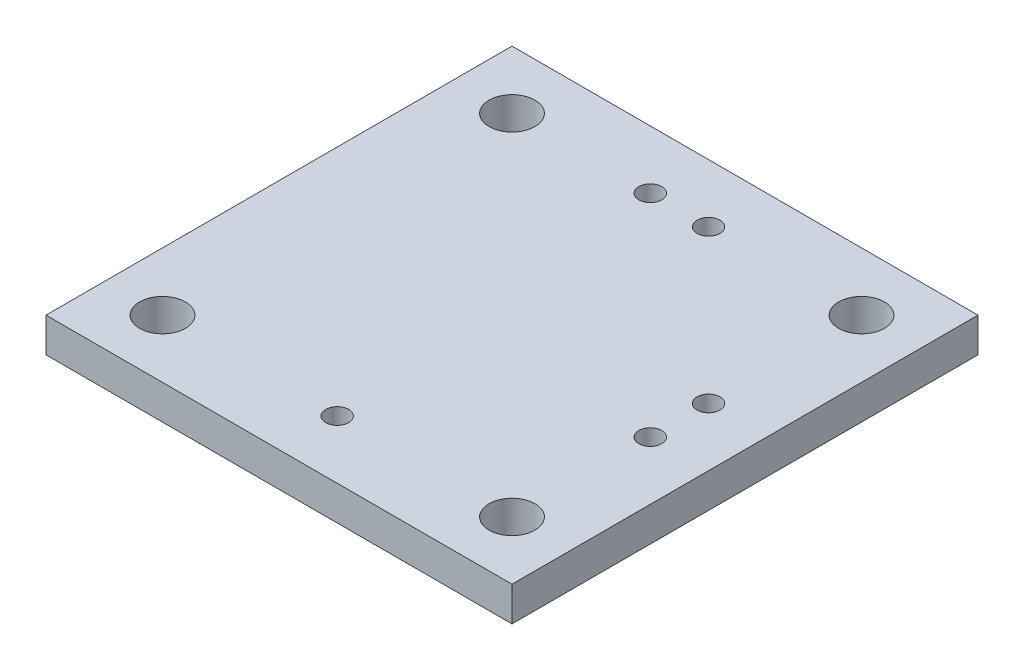
ISO-10303-21;
HEADER;
FILE_DESCRIPTION(('STEP AP214'),'2;1');
FILE_NAME('part.step','',(''),(''),'','','');
FILE_SCHEMA(('AUTOMOTIVE_DESIGN { 1 0 10303 214 1 1 1 1 }'));
ENDSEC;
DATA;
#1=APPLICATION_CONTEXT('core data for automotive mechanical design processes');
#2=APPLICATION_PROTOCOL_DEFINITION('international standard','automotive_design',2000,#1);
#3=PRODUCT_CONTEXT('',#1,'mechanical');
#4=PRODUCT('Part','Part','',(#3));
#5=PRODUCT_RELATED_PRODUCT_CATEGORY('part','',(#4));
#6=PRODUCT_DEFINITION_FORMATION('','',#4);
#7=PRODUCT_DEFINITION_CONTEXT('part definition',#1,'design');
#8=PRODUCT_DEFINITION('design','',#6,#7);
#9=PRODUCT_DEFINITION_SHAPE('','',#8);
#10=(LENGTH_UNIT() NAMED_UNIT(*) SI_UNIT(.MILLI.,.METRE.));
#11=(NAMED_UNIT(*) PLANE_ANGLE_UNIT() SI_UNIT($,.RADIAN.));
#12=(NAMED_UNIT(*) SI_UNIT($,.STERADIAN.) SOLID_ANGLE_UNIT());
#13=UNCERTAINTY_MEASURE_WITH_UNIT(LENGTH_MEASURE(1.E-05),#10,'distance_accuracy_value','');
#14=(GEOMETRIC_REPRESENTATION_CONTEXT(3) GLOBAL_UNCERTAINTY_ASSIGNED_CONTEXT((#13)) GLOBAL_UNIT_ASSIGNED_CONTEXT((#10,
#11,#12)) REPRESENTATION_CONTEXT('',''));
#15=CARTESIAN_POINT('',(0.,0.,0.));
#16=DIRECTION('',(0.,0.,1.));
#17=DIRECTION('',(1.,0.,0.));
#18=AXIS2_PLACEMENT_3D('',#15,#16,#17);
#19=CARTESIAN_POINT('',(0.,1.5,0.));
#20=DIRECTION('',(0.,1.,0.));
#21=DIRECTION('',(0.,0.,1.));
#22=AXIS2_PLACEMENT_3D('',#19,#20,#21);
#23=PLANE('',#22);
#24=CARTESIAN_POINT('',(8.569999878,1.5,-17.78));
#25=DIRECTION('',(0.,1.,0.));
#26=DIRECTION('',(0.,0.,1.));
#27=AXIS2_PLACEMENT_3D('',#24,#25,#26);
#28=CIRCLE('',#27,0.500000000000001);
#29=CARTESIAN_POINT('',(8.569999878,1.5,-17.28));
#30=VERTEX_POINT('',#29);
#31=EDGE_CURVE('E407',#30,#30,#28,.T.);
#32=ORIENTED_EDGE('',*,*,#31,.F.);
#33=EDGE_LOOP('',(#32));
#34=FACE_BOUND('',#33,.T.);
#35=CARTESIAN_POINT('',(17.78,1.5,-8.57));
#36=DIRECTION('',(0.,1.,0.));
#37=DIRECTION('',(0.,0.,1.));
#38=AXIS2_PLACEMENT_3D('',#35,#36,#37);
#39=CIRCLE('',#38,0.499999999999999);
#40=CARTESIAN_POINT('',(17.78,1.5,-8.07));
#41=VERTEX_POINT('',#40);
#42=EDGE_CURVE('E419',#41,#41,#39,.F.);
#43=ORIENTED_EDGE('',*,*,#42,.T.);
#44=EDGE_LOOP('',(#43));
#45=FACE_BOUND('',#44,.T.);
#46=CARTESIAN_POINT('',(17.78,1.5,-11.11));
#47=DIRECTION('',(0.,1.,0.));
#48=DIRECTION('',(0.,0.,1.));
#49=AXIS2_PLACEMENT_3D('',#46,#47,#48);
#50=CIRCLE('',#49,0.499999999999999);
#51=CARTESIAN_POINT('',(17.78,1.5,-10.61));
#52=VERTEX_POINT('',#51);
#53=EDGE_CURVE('E202',#52,#52,#50,.T.);
#54=ORIENTED_EDGE('',*,*,#53,.F.);
#55=EDGE_LOOP('',(#54));
#56=FACE_BOUND('',#55,.T.);
#57=CARTESIAN_POINT('',(10.16,1.5,-2.54));
#58=DIRECTION('',(0.,1.,0.));
#59=DIRECTION('',(0.,0.,1.));
#60=AXIS2_PLACEMENT_3D('',#57,#58,#59);
#61=CIRCLE('',#60,0.500000000000001);
#62=CARTESIAN_POINT('',(10.16,1.5,-2.04));
#63=VERTEX_POINT('',#62);
#64=EDGE_CURVE('E189',#63,#63,#61,.T.);
#65=ORIENTED_EDGE('',*,*,#64,.F.);
#66=EDGE_LOOP('',(#65));
#67=FACE_BOUND('',#66,.T.);
#68=CARTESIAN_POINT('',(17.78,1.5,-2.54));
#69=DIRECTION('',(0.,1.,0.));
#70=DIRECTION('',(0.,0.,1.));
#71=AXIS2_PLACEMENT_3D('',#68,#69,#70);
#72=CIRCLE('',#71,0.999999999999998);
#73=CARTESIAN_POINT('',(17.78,1.5,-1.54));
#74=VERTEX_POINT('',#73);
#75=EDGE_CURVE('E194',#74,#74,#72,.F.);
#76=ORIENTED_EDGE('',*,*,#75,.T.);
#77=EDGE_LOOP('',(#76));
#78=FACE_BOUND('',#77,.T.);
#79=CARTESIAN_POINT('',(2.54,1.5,-2.54));
#80=DIRECTION('',(0.,1.,0.));
#81=DIRECTION('',(0.,0.,1.));
#82=AXIS2_PLACEMENT_3D('',#79,#80,#81);
#83=CIRCLE('',#82,1.);
#84=CARTESIAN_POINT('',(2.54,1.5,-1.54));
#85=VERTEX_POINT('',#84);
#86=EDGE_CURVE('E199',#85,#85,#83,.T.);
#87=ORIENTED_EDGE('',*,*,#86,.F.);
#88=EDGE_LOOP('',(#87));
#89=FACE_BOUND('',#88,.T.);
#90=DIRECTION('',(1.,0.,0.));
#91=VECTOR('',#90,1.);
#92=CARTESIAN_POINT('',(0.,1.5,0.));
#93=LINE('',#92,#91);
#94=CARTESIAN_POINT('',(0.,1.5,0.));
#95=VERTEX_POINT('',#94);
#96=CARTESIAN_POINT('',(20.32,1.5,0.));
#97=VERTEX_POINT('',#96);
#98=EDGE_CURVE('E145',#95,#97,#93,.T.);
#99=ORIENTED_EDGE('',*,*,#98,.T.);
#100=DIRECTION('',(0.,0.,-1.));
#101=VECTOR('',#100,1.);
#102=CARTESIAN_POINT('',(20.32,1.5,0.));
#103=LINE('',#102,#101);
#104=CARTESIAN_POINT('',(20.32,1.5,-20.32));
#105=VERTEX_POINT('',#104);
#106=EDGE_CURVE('E137',#97,#105,#103,.T.);
#107=ORIENTED_EDGE('',*,*,#106,.T.);
#108=DIRECTION('',(1.,0.,0.));
#109=VECTOR('',#108,1.);
#110=CARTESIAN_POINT('',(0.,1.5,-20.32));
#111=LINE('',#110,#109);
#112=CARTESIAN_POINT('',(0.,1.5,-20.32));
#113=VERTEX_POINT('',#112);
#114=EDGE_CURVE('E144',#113,#105,#111,.T.);
#115=ORIENTED_EDGE('',*,*,#114,.F.);
#116=DIRECTION('',(0.,0.,-1.));
#117=VECTOR('',#116,1.);
#118=CARTESIAN_POINT('',(0.,1.5,0.));
#119=LINE('',#118,#117);
#120=EDGE_CURVE('E154',#95,#113,#119,.T.);
#121=ORIENTED_EDGE('',*,*,#120,.F.);
#122=EDGE_LOOP('',(#99,#107,#115,#121));
#123=FACE_BOUND('',#122,.T.);
#124=CARTESIAN_POINT('',(17.78,1.5,-17.78));
#125=DIRECTION('',(0.,1.,0.));
#126=DIRECTION('',(0.,0.,1.));
#127=AXIS2_PLACEMENT_3D('',#124,#125,#126);
#128=CIRCLE('',#127,0.999999999999998);
#129=CARTESIAN_POINT('',(17.78,1.5,-16.78));
#130=VERTEX_POINT('',#129);
#131=EDGE_CURVE('E156',#130,#130,#128,.T.);
#132=ORIENTED_EDGE('',*,*,#131,.F.);
#133=EDGE_LOOP('',(#132));
#134=FACE_BOUND('',#133,.T.);
#135=CARTESIAN_POINT('',(2.54,1.5,-17.78));
#136=DIRECTION('',(0.,1.,0.));
#137=DIRECTION('',(0.,0.,1.));
#138=AXIS2_PLACEMENT_3D('',#135,#136,#137);
#139=CIRCLE('',#138,0.999999999999999);
#140=CARTESIAN_POINT('',(2.54,1.5,-16.78));
#141=VERTEX_POINT('',#140);
#142=EDGE_CURVE('E162',#141,#141,#139,.F.);
#143=ORIENTED_EDGE('',*,*,#142,.T.);
#144=EDGE_LOOP('',(#143));
#145=FACE_BOUND('',#144,.T.);
#146=CARTESIAN_POINT('',(11.109999878,1.5,-17.78));
#147=DIRECTION('',(0.,-1.,0.));
#148=DIRECTION('',(0.,0.,-1.));
#149=AXIS2_PLACEMENT_3D('',#146,#147,#148);
#150=CIRCLE('',#149,0.500000000000001);
#151=CARTESIAN_POINT('',(11.109999878,1.5,-18.28));
#152=VERTEX_POINT('',#151);
#153=EDGE_CURVE('E413',#152,#152,#150,.T.);
#154=ORIENTED_EDGE('',*,*,#153,.T.);
#155=EDGE_LOOP('',(#154));
#156=FACE_BOUND('',#155,.T.);
#157=ADVANCED_FACE('F95',(#34,#45,#56,#67,#78,#89,#123,#134,#145,#156),#23,.T.);
#158=CARTESIAN_POINT('',(2.54,1.5,-17.78));
#159=DIRECTION('',(0.,-1.,0.));
#160=DIRECTION('',(0.,0.,-1.));
#161=AXIS2_PLACEMENT_3D('',#158,#159,#160);
#162=CYLINDRICAL_SURFACE('',#161,0.999999999999999);
#163=ORIENTED_EDGE('',*,*,#142,.F.);
#164=EDGE_LOOP('',(#163));
#165=FACE_BOUND('',#164,.T.);
#166=CARTESIAN_POINT('',(2.54,0.,-17.78));
#167=DIRECTION('',(0.,1.,0.));
#168=DIRECTION('',(0.,0.,1.));
#169=AXIS2_PLACEMENT_3D('',#166,#167,#168);
#170=CIRCLE('',#169,0.999999999999999);
#171=CARTESIAN_POINT('',(2.54,0.,-16.78));
#172=VERTEX_POINT('',#171);
#173=EDGE_CURVE('E186',#172,#172,#170,.F.);
#174=ORIENTED_EDGE('',*,*,#173,.T.);
#175=EDGE_LOOP('',(#174));
#176=FACE_BOUND('',#175,.T.);
#177=ADVANCED_FACE('F212',(#165,#176),#162,.F.);
#178=CARTESIAN_POINT('',(17.78,1.5,-17.78));
#179=DIRECTION('',(0.,-1.,0.));
#180=DIRECTION('',(0.,0.,-1.));
#181=AXIS2_PLACEMENT_3D('',#178,#179,#180);
#182=CYLINDRICAL_SURFACE('',#181,0.999999999999998);
#183=ORIENTED_EDGE('',*,*,#131,.T.);
#184=EDGE_LOOP('',(#183));
#185=FACE_BOUND('',#184,.T.);
#186=CARTESIAN_POINT('',(17.78,0.,-17.78));
#187=DIRECTION('',(0.,1.,0.));
#188=DIRECTION('',(0.,0.,1.));
#189=AXIS2_PLACEMENT_3D('',#186,#187,#188);
#190=CIRCLE('',#189,0.999999999999998);
#191=CARTESIAN_POINT('',(17.78,0.,-16.78));
#192=VERTEX_POINT('',#191);
#193=EDGE_CURVE('E183',#192,#192,#190,.T.);
#194=ORIENTED_EDGE('',*,*,#193,.F.);
#195=EDGE_LOOP('',(#194));
#196=FACE_BOUND('',#195,.T.);
#197=ADVANCED_FACE('F218',(#185,#196),#182,.F.);
#198=CARTESIAN_POINT('',(20.32,1.5,0.));
#199=DIRECTION('',(-1.,0.,0.));
#200=DIRECTION('',(0.,0.,1.));
#201=AXIS2_PLACEMENT_3D('',#198,#199,#200);
#202=PLANE('',#201);
#203=DIRECTION('',(0.,0.,-1.));
#204=VECTOR('',#203,1.);
#205=CARTESIAN_POINT('',(20.32,0.,0.));
#206=LINE('',#205,#204);
#207=CARTESIAN_POINT('',(20.32,0.,0.));
#208=VERTEX_POINT('',#207);
#209=CARTESIAN_POINT('',(20.32,0.,-20.32));
#210=VERTEX_POINT('',#209);
#211=EDGE_CURVE('E150',#208,#210,#206,.T.);
#212=ORIENTED_EDGE('',*,*,#211,.T.);
#213=DIRECTION('',(0.,-1.,0.));
#214=VECTOR('',#213,1.);
#215=CARTESIAN_POINT('',(20.32,1.5,-20.32));
#216=LINE('',#215,#214);
#217=EDGE_CURVE('E104',#105,#210,#216,.T.);
#218=ORIENTED_EDGE('',*,*,#217,.F.);
#219=ORIENTED_EDGE('',*,*,#106,.F.);
#220=DIRECTION('',(0.,-1.,0.));
#221=VECTOR('',#220,1.);
#222=CARTESIAN_POINT('',(20.32,1.5,0.));
#223=LINE('',#222,#221);
#224=EDGE_CURVE('E12',#97,#208,#223,.T.);
#225=ORIENTED_EDGE('',*,*,#224,.T.);
#226=EDGE_LOOP('',(#212,#218,#219,#225));
#227=FACE_BOUND('',#226,.T.);
#228=ADVANCED_FACE('F149',(#227),#202,.F.);
#229=CARTESIAN_POINT('',(0.,1.5,-20.32));
#230=DIRECTION('',(0.,0.,-1.));
#231=DIRECTION('',(-1.,0.,0.));
#232=AXIS2_PLACEMENT_3D('',#229,#230,#231);
#233=PLANE('',#232);
#234=DIRECTION('',(1.,0.,0.));
#235=VECTOR('',#234,1.);
#236=CARTESIAN_POINT('',(0.,0.,-20.32));
#237=LINE('',#236,#235);
#238=CARTESIAN_POINT('',(0.,0.,-20.32));
#239=VERTEX_POINT('',#238);
#240=EDGE_CURVE('E178',#239,#210,#237,.T.);
#241=ORIENTED_EDGE('',*,*,#240,.F.);
#242=DIRECTION('',(0.,-1.,0.));
#243=VECTOR('',#242,1.);
#244=CARTESIAN_POINT('',(0.,1.5,-20.32));
#245=LINE('',#244,#243);
#246=EDGE_CURVE('E126',#113,#239,#245,.T.);
#247=ORIENTED_EDGE('',*,*,#246,.F.);
#248=ORIENTED_EDGE('',*,*,#114,.T.);
#249=ORIENTED_EDGE('',*,*,#217,.T.);
#250=EDGE_LOOP('',(#241,#247,#248,#249));
#251=FACE_BOUND('',#250,.T.);
#252=ADVANCED_FACE('F153',(#251),#233,.T.);
#253=CARTESIAN_POINT('',(0.,1.5,0.));
#254=DIRECTION('',(-1.,0.,0.));
#255=DIRECTION('',(0.,0.,1.));
#256=AXIS2_PLACEMENT_3D('',#253,#254,#255);
#257=PLANE('',#256);
#258=DIRECTION('',(0.,0.,-1.));
#259=VECTOR('',#258,1.);
#260=CARTESIAN_POINT('',(0.,0.,0.));
#261=LINE('',#260,#259);
#262=CARTESIAN_POINT('',(0.,0.,0.));
#263=VERTEX_POINT('',#262);
#264=EDGE_CURVE('E180',#263,#239,#261,.T.);
#265=ORIENTED_EDGE('',*,*,#264,.F.);
#266=DIRECTION('',(0.,-1.,0.));
#267=VECTOR('',#266,1.);
#268=CARTESIAN_POINT('',(0.,1.5,0.));
#269=LINE('',#268,#267);
#270=EDGE_CURVE('E112',#95,#263,#269,.T.);
#271=ORIENTED_EDGE('',*,*,#270,.F.);
#272=ORIENTED_EDGE('',*,*,#120,.T.);
#273=ORIENTED_EDGE('',*,*,#246,.T.);
#274=EDGE_LOOP('',(#265,#271,#272,#273));
#275=FACE_BOUND('',#274,.T.);
#276=ADVANCED_FACE('F234',(#275),#257,.T.);
#277=CARTESIAN_POINT('',(0.,1.5,0.));
#278=DIRECTION('',(0.,0.,-1.));
#279=DIRECTION('',(-1.,0.,0.));
#280=AXIS2_PLACEMENT_3D('',#277,#278,#279);
#281=PLANE('',#280);
#282=DIRECTION('',(1.,0.,0.));
#283=VECTOR('',#282,1.);
#284=CARTESIAN_POINT('',(0.,0.,0.));
#285=LINE('',#284,#283);
#286=EDGE_CURVE('E175',#263,#208,#285,.T.);
#287=ORIENTED_EDGE('',*,*,#286,.T.);
#288=ORIENTED_EDGE('',*,*,#224,.F.);
#289=ORIENTED_EDGE('',*,*,#98,.F.);
#290=ORIENTED_EDGE('',*,*,#270,.T.);
#291=EDGE_LOOP('',(#287,#288,#289,#290));
#292=FACE_BOUND('',#291,.T.);
#293=ADVANCED_FACE('F237',(#292),#281,.F.);
#294=CARTESIAN_POINT('',(2.54,1.5,-2.54));
#295=DIRECTION('',(0.,-1.,0.));
#296=DIRECTION('',(0.,0.,-1.));
#297=AXIS2_PLACEMENT_3D('',#294,#295,#296);
#298=CYLINDRICAL_SURFACE('',#297,1.);
#299=ORIENTED_EDGE('',*,*,#86,.T.);
#300=EDGE_LOOP('',(#299));
#301=FACE_BOUND('',#300,.T.);
#302=CARTESIAN_POINT('',(2.54,0.,-2.54));
#303=DIRECTION('',(0.,1.,0.));
#304=DIRECTION('',(0.,0.,1.));
#305=AXIS2_PLACEMENT_3D('',#302,#303,#304);
#306=CIRCLE('',#305,1.);
#307=CARTESIAN_POINT('',(2.54,0.,-1.54));
#308=VERTEX_POINT('',#307);
#309=EDGE_CURVE('E172',#308,#308,#306,.T.);
#310=ORIENTED_EDGE('',*,*,#309,.F.);
#311=EDGE_LOOP('',(#310));
#312=FACE_BOUND('',#311,.T.);
#313=ADVANCED_FACE('F208',(#301,#312),#298,.F.);
#314=CARTESIAN_POINT('',(17.78,1.5,-2.54));
#315=DIRECTION('',(0.,-1.,0.));
#316=DIRECTION('',(0.,0.,-1.));
#317=AXIS2_PLACEMENT_3D('',#314,#315,#316);
#318=CYLINDRICAL_SURFACE('',#317,0.999999999999998);
#319=ORIENTED_EDGE('',*,*,#75,.F.);
#320=EDGE_LOOP('',(#319));
#321=FACE_BOUND('',#320,.T.);
#322=CARTESIAN_POINT('',(17.78,0.,-2.54));
#323=DIRECTION('',(0.,1.,0.));
#324=DIRECTION('',(0.,0.,1.));
#325=AXIS2_PLACEMENT_3D('',#322,#323,#324);
#326=CIRCLE('',#325,0.999999999999998);
#327=CARTESIAN_POINT('',(17.78,0.,-1.54));
#328=VERTEX_POINT('',#327);
#329=EDGE_CURVE('E168',#328,#328,#326,.F.);
#330=ORIENTED_EDGE('',*,*,#329,.T.);
#331=EDGE_LOOP('',(#330));
#332=FACE_BOUND('',#331,.T.);
#333=ADVANCED_FACE('F245',(#321,#332),#318,.F.);
#334=CARTESIAN_POINT('',(10.16,1.5,-2.54));
#335=DIRECTION('',(0.,-1.,0.));
#336=DIRECTION('',(0.,0.,-1.));
#337=AXIS2_PLACEMENT_3D('',#334,#335,#336);
#338=CYLINDRICAL_SURFACE('',#337,0.500000000000001);
#339=ORIENTED_EDGE('',*,*,#64,.T.);
#340=EDGE_LOOP('',(#339));
#341=FACE_BOUND('',#340,.T.);
#342=CARTESIAN_POINT('',(10.16,0.,-2.54));
#343=DIRECTION('',(0.,1.,0.));
#344=DIRECTION('',(0.,0.,1.));
#345=AXIS2_PLACEMENT_3D('',#342,#343,#344);
#346=CIRCLE('',#345,0.500000000000001);
#347=CARTESIAN_POINT('',(10.16,0.,-2.04));
#348=VERTEX_POINT('',#347);
#349=EDGE_CURVE('E165',#348,#348,#346,.T.);
#350=ORIENTED_EDGE('',*,*,#349,.F.);
#351=EDGE_LOOP('',(#350));
#352=FACE_BOUND('',#351,.T.);
#353=ADVANCED_FACE('F97',(#341,#352),#338,.F.);
#354=CARTESIAN_POINT('',(0.,0.,0.));
#355=DIRECTION('',(0.,1.,0.));
#356=DIRECTION('',(0.,0.,1.));
#357=AXIS2_PLACEMENT_3D('',#354,#355,#356);
#358=PLANE('',#357);
#359=ORIENTED_EDGE('',*,*,#349,.T.);
#360=EDGE_LOOP('',(#359));
#361=FACE_BOUND('',#360,.T.);
#362=ORIENTED_EDGE('',*,*,#329,.F.);
#363=EDGE_LOOP('',(#362));
#364=FACE_BOUND('',#363,.T.);
#365=ORIENTED_EDGE('',*,*,#309,.T.);
#366=EDGE_LOOP('',(#365));
#367=FACE_BOUND('',#366,.T.);
#368=ORIENTED_EDGE('',*,*,#286,.F.);
#369=ORIENTED_EDGE('',*,*,#264,.T.);
#370=ORIENTED_EDGE('',*,*,#240,.T.);
#371=ORIENTED_EDGE('',*,*,#211,.F.);
#372=EDGE_LOOP('',(#368,#369,#370,#371));
#373=FACE_BOUND('',#372,.T.);
#374=ORIENTED_EDGE('',*,*,#193,.T.);
#375=EDGE_LOOP('',(#374));
#376=FACE_BOUND('',#375,.T.);
#377=ORIENTED_EDGE('',*,*,#173,.F.);
#378=EDGE_LOOP('',(#377));
#379=FACE_BOUND('',#378,.T.);
#380=ADVANCED_FACE('F227',(#361,#364,#367,#373,#376,#379),#358,.F.);
#381=CARTESIAN_POINT('',(17.78,0.738,-11.11));
#382=DIRECTION('',(0.,1.,0.));
#383=DIRECTION('',(0.,0.,1.));
#384=AXIS2_PLACEMENT_3D('',#381,#382,#383);
#385=CYLINDRICAL_SURFACE('',#384,0.499999999999999);
#386=CARTESIAN_POINT('',(17.78,0.738,-11.11));
#387=DIRECTION('',(0.,1.,0.));
#388=DIRECTION('',(0.,0.,1.));
#389=AXIS2_PLACEMENT_3D('',#386,#387,#388);
#390=CIRCLE('',#389,0.499999999999999);
#391=CARTESIAN_POINT('',(17.78,0.738,-10.61));
#392=VERTEX_POINT('',#391);
#393=EDGE_CURVE('E169',#392,#392,#390,.T.);
#394=ORIENTED_EDGE('',*,*,#393,.F.);
#395=EDGE_LOOP('',(#394));
#396=FACE_BOUND('',#395,.T.);
#397=ORIENTED_EDGE('',*,*,#53,.T.);
#398=EDGE_LOOP('',(#397));
#399=FACE_BOUND('',#398,.T.);
#400=ADVANCED_FACE('F225',(#396,#399),#385,.F.);
#401=CARTESIAN_POINT('',(0.,0.738,0.));
#402=DIRECTION('',(0.,1.,0.));
#403=DIRECTION('',(0.,0.,1.));
#404=AXIS2_PLACEMENT_3D('',#401,#402,#403);
#405=PLANE('',#404);
#406=ORIENTED_EDGE('',*,*,#393,.T.);
#407=EDGE_LOOP('',(#406));
#408=FACE_BOUND('',#407,.T.);
#409=ADVANCED_FACE('F277',(#408),#405,.T.);
#410=CARTESIAN_POINT('',(17.78,0.738,-8.57));
#411=DIRECTION('',(0.,1.,0.));
#412=DIRECTION('',(0.,0.,1.));
#413=AXIS2_PLACEMENT_3D('',#410,#411,#412);
#414=CYLINDRICAL_SURFACE('',#413,0.499999999999999);
#415=CARTESIAN_POINT('',(17.78,0.738,-8.57));
#416=DIRECTION('',(0.,1.,0.));
#417=DIRECTION('',(0.,0.,1.));
#418=AXIS2_PLACEMENT_3D('',#415,#416,#417);
#419=CIRCLE('',#418,0.499999999999999);
#420=CARTESIAN_POINT('',(17.78,0.738,-8.07));
#421=VERTEX_POINT('',#420);
#422=EDGE_CURVE('E416',#421,#421,#419,.F.);
#423=ORIENTED_EDGE('',*,*,#422,.T.);
#424=EDGE_LOOP('',(#423));
#425=FACE_BOUND('',#424,.T.);
#426=ORIENTED_EDGE('',*,*,#42,.F.);
#427=EDGE_LOOP('',(#426));
#428=FACE_BOUND('',#427,.T.);
#429=ADVANCED_FACE('F284',(#425,#428),#414,.F.);
#430=CARTESIAN_POINT('',(0.,0.738,0.));
#431=DIRECTION('',(0.,1.,0.));
#432=DIRECTION('',(0.,0.,1.));
#433=AXIS2_PLACEMENT_3D('',#430,#431,#432);
#434=PLANE('',#433);
#435=ORIENTED_EDGE('',*,*,#422,.F.);
#436=EDGE_LOOP('',(#435));
#437=FACE_BOUND('',#436,.T.);
#438=ADVANCED_FACE('F291',(#437),#434,.T.);
#439=CARTESIAN_POINT('',(11.109999878,0.738,-17.78));
#440=DIRECTION('',(0.,1.,0.));
#441=DIRECTION('',(0.,0.,1.));
#442=AXIS2_PLACEMENT_3D('',#439,#440,#441);
#443=CYLINDRICAL_SURFACE('',#442,0.500000000000001);
#444=CARTESIAN_POINT('',(11.109999878,0.738,-17.78));
#445=DIRECTION('',(0.,-1.,0.));
#446=DIRECTION('',(0.,0.,-1.));
#447=AXIS2_PLACEMENT_3D('',#444,#445,#446);
#448=CIRCLE('',#447,0.500000000000001);
#449=CARTESIAN_POINT('',(11.109999878,0.738,-18.28));
#450=VERTEX_POINT('',#449);
#451=EDGE_CURVE('E410',#450,#450,#448,.T.);
#452=ORIENTED_EDGE('',*,*,#451,.T.);
#453=EDGE_LOOP('',(#452));
#454=FACE_BOUND('',#453,.T.);
#455=ORIENTED_EDGE('',*,*,#153,.F.);
#456=EDGE_LOOP('',(#455));
#457=FACE_BOUND('',#456,.T.);
#458=ADVANCED_FACE('F299',(#454,#457),#443,.F.);
#459=CARTESIAN_POINT('',(11.109999878,0.738,-17.78));
#460=DIRECTION('',(0.,-1.,0.));
#461=DIRECTION('',(0.,0.,-1.));
#462=AXIS2_PLACEMENT_3D('',#459,#460,#461);
#463=PLANE('',#462);
#464=ORIENTED_EDGE('',*,*,#451,.F.);
#465=EDGE_LOOP('',(#464));
#466=FACE_BOUND('',#465,.T.);
#467=ADVANCED_FACE('F307',(#466),#463,.F.);
#468=CARTESIAN_POINT('',(8.569999878,0.738,-17.78));
#469=DIRECTION('',(0.,1.,0.));
#470=DIRECTION('',(0.,0.,1.));
#471=AXIS2_PLACEMENT_3D('',#468,#469,#470);
#472=CYLINDRICAL_SURFACE('',#471,0.500000000000001);
#473=CARTESIAN_POINT('',(8.569999878,0.738,-17.78));
#474=DIRECTION('',(0.,1.,0.));
#475=DIRECTION('',(0.,0.,1.));
#476=AXIS2_PLACEMENT_3D('',#473,#474,#475);
#477=CIRCLE('',#476,0.500000000000001);
#478=CARTESIAN_POINT('',(8.569999878,0.738,-17.28));
#479=VERTEX_POINT('',#478);
#480=EDGE_CURVE('E406',#479,#479,#477,.T.);
#481=ORIENTED_EDGE('',*,*,#480,.F.);
#482=EDGE_LOOP('',(#481));
#483=FACE_BOUND('',#482,.T.);
#484=ORIENTED_EDGE('',*,*,#31,.T.);
#485=EDGE_LOOP('',(#484));
#486=FACE_BOUND('',#485,.T.);
#487=ADVANCED_FACE('F315',(#483,#486),#472,.F.);
#488=CARTESIAN_POINT('',(8.569999878,0.738,-17.78));
#489=DIRECTION('',(0.,1.,0.));
#490=DIRECTION('',(0.,0.,1.));
#491=AXIS2_PLACEMENT_3D('',#488,#489,#490);
#492=PLANE('',#491);
#493=ORIENTED_EDGE('',*,*,#480,.T.);
#494=EDGE_LOOP('',(#493));
#495=FACE_BOUND('',#494,.T.);
#496=ADVANCED_FACE('F323',(#495),#492,.T.);
#497=CLOSED_SHELL('',(#157,#177,#197,#228,#252,#276,#293,#313,#333,#353,#380,#400,#409,#429,
#438,#458,#467,#487,#496));
#498=MANIFOLD_SOLID_BREP('B2',#497);
#499=ADVANCED_BREP_SHAPE_REPRESENTATION('',(#18,#498),#14);
#500=SHAPE_DEFINITION_REPRESENTATION(#9,#499);
ENDSEC;
END-ISO-10303-21;
